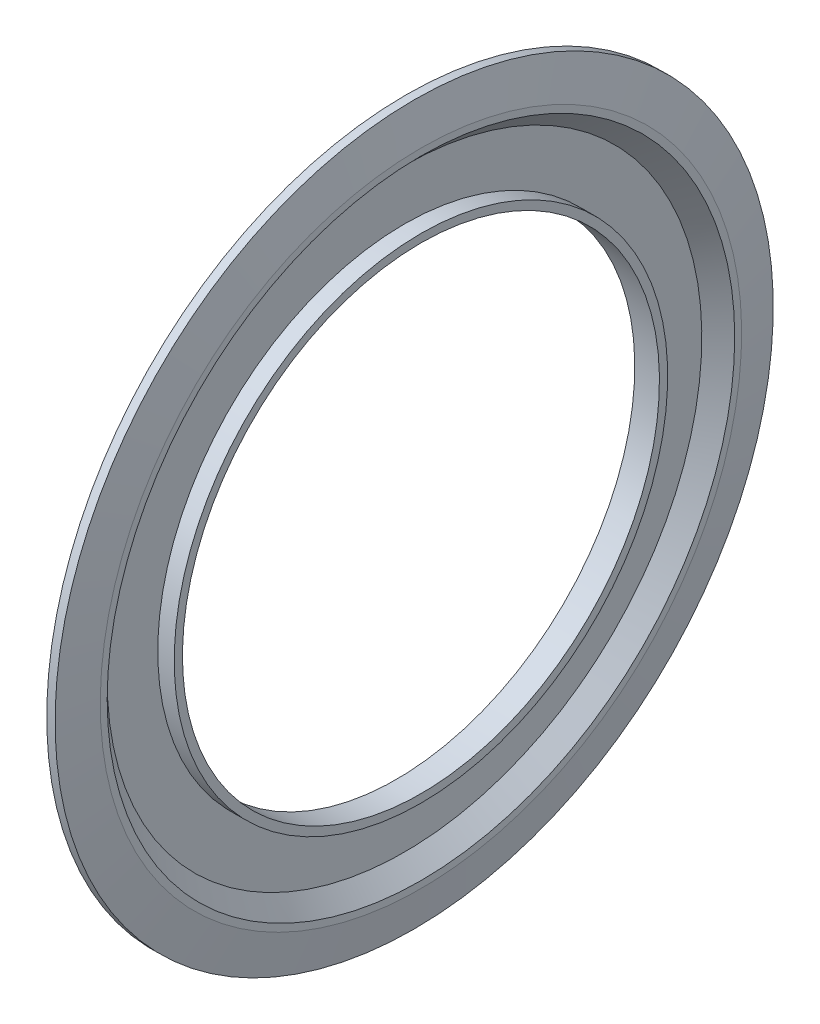
ISO-10303-21;
HEADER;
FILE_DESCRIPTION(('STEP AP214'),'2;1');
FILE_NAME('part.step','',(''),(''),'','','');
FILE_SCHEMA(('AUTOMOTIVE_DESIGN { 1 0 10303 214 1 1 1 1 }'));
ENDSEC;
DATA;
#1=APPLICATION_CONTEXT('core data for automotive mechanical design processes');
#2=APPLICATION_PROTOCOL_DEFINITION('international standard','automotive_design',2000,#1);
#3=PRODUCT_CONTEXT('',#1,'mechanical');
#4=PRODUCT('Part','Part','',(#3));
#5=PRODUCT_RELATED_PRODUCT_CATEGORY('part','',(#4));
#6=PRODUCT_DEFINITION_FORMATION('','',#4);
#7=PRODUCT_DEFINITION_CONTEXT('part definition',#1,'design');
#8=PRODUCT_DEFINITION('design','',#6,#7);
#9=PRODUCT_DEFINITION_SHAPE('','',#8);
#10=(LENGTH_UNIT() NAMED_UNIT(*) SI_UNIT(.MILLI.,.METRE.));
#11=(NAMED_UNIT(*) PLANE_ANGLE_UNIT() SI_UNIT($,.RADIAN.));
#12=(NAMED_UNIT(*) SI_UNIT($,.STERADIAN.) SOLID_ANGLE_UNIT());
#13=UNCERTAINTY_MEASURE_WITH_UNIT(LENGTH_MEASURE(1.E-05),#10,'distance_accuracy_value','');
#14=(GEOMETRIC_REPRESENTATION_CONTEXT(3) GLOBAL_UNCERTAINTY_ASSIGNED_CONTEXT((#13)) GLOBAL_UNIT_ASSIGNED_CONTEXT((#10,
#11,#12)) REPRESENTATION_CONTEXT('',''));
#15=CARTESIAN_POINT('',(0.,0.,0.));
#16=DIRECTION('',(0.,0.,1.));
#17=DIRECTION('',(1.,0.,0.));
#18=AXIS2_PLACEMENT_3D('',#15,#16,#17);
#19=CARTESIAN_POINT('',(0.762871315483505,7.518,0.));
#20=DIRECTION('',(1.,0.,0.));
#21=DIRECTION('',(0.,-1.,0.));
#22=AXIS2_PLACEMENT_3D('',#19,#20,#21);
#23=PLANE('',#22);
#24=CARTESIAN_POINT('',(0.762871315483505,0.,0.));
#25=DIRECTION('',(-1.,0.,0.));
#26=DIRECTION('',(0.,1.,0.));
#27=AXIS2_PLACEMENT_3D('',#24,#25,#26);
#28=CIRCLE('',#27,7.436);
#29=CARTESIAN_POINT('',(0.762871315483505,7.436,0.));
#30=VERTEX_POINT('',#29);
#31=EDGE_CURVE('E11',#30,#30,#28,.T.);
#32=ORIENTED_EDGE('',*,*,#31,.T.);
#33=EDGE_LOOP('',(#32));
#34=FACE_BOUND('',#33,.T.);
#35=CARTESIAN_POINT('',(0.762871315483505,0.,0.));
#36=DIRECTION('',(-1.,0.,0.));
#37=DIRECTION('',(0.,1.,0.));
#38=AXIS2_PLACEMENT_3D('',#35,#36,#37);
#39=CIRCLE('',#38,7.6);
#40=CARTESIAN_POINT('',(0.762871315483505,7.6,0.));
#41=VERTEX_POINT('',#40);
#42=EDGE_CURVE('E69',#41,#41,#39,.T.);
#43=ORIENTED_EDGE('',*,*,#42,.F.);
#44=EDGE_LOOP('',(#43));
#45=FACE_BOUND('',#44,.T.);
#46=ADVANCED_FACE('F16',(#34,#45),#23,.T.);
#47=CARTESIAN_POINT('',(0.567871315483505,0.,0.));
#48=DIRECTION('',(1.,0.,0.));
#49=DIRECTION('',(0.,1.,0.));
#50=AXIS2_PLACEMENT_3D('',#47,#48,#49);
#51=CONICAL_SURFACE('',#50,7.241,0.785398163397447);
#52=CARTESIAN_POINT('',(0.372871315483505,0.,0.));
#53=DIRECTION('',(-1.,0.,0.));
#54=DIRECTION('',(0.,1.,0.));
#55=AXIS2_PLACEMENT_3D('',#52,#53,#54);
#56=CIRCLE('',#55,7.046);
#57=CARTESIAN_POINT('',(0.372871315483505,7.046,0.));
#58=VERTEX_POINT('',#57);
#59=EDGE_CURVE('E20',#58,#58,#56,.T.);
#60=ORIENTED_EDGE('',*,*,#59,.T.);
#61=EDGE_LOOP('',(#60));
#62=FACE_BOUND('',#61,.T.);
#63=ORIENTED_EDGE('',*,*,#31,.F.);
#64=EDGE_LOOP('',(#63));
#65=FACE_BOUND('',#64,.T.);
#66=ADVANCED_FACE('F18',(#62,#65),#51,.F.);
#67=CARTESIAN_POINT('',(0.372871315483504,6.44675,0.));
#68=DIRECTION('',(1.,0.,0.));
#69=DIRECTION('',(0.,-1.,0.));
#70=AXIS2_PLACEMENT_3D('',#67,#68,#69);
#71=PLANE('',#70);
#72=CARTESIAN_POINT('',(0.372871315483504,0.,0.));
#73=DIRECTION('',(-1.,0.,0.));
#74=DIRECTION('',(0.,1.,0.));
#75=AXIS2_PLACEMENT_3D('',#72,#73,#74);
#76=CIRCLE('',#75,5.8475);
#77=CARTESIAN_POINT('',(0.372871315483504,5.8475,0.));
#78=VERTEX_POINT('',#77);
#79=EDGE_CURVE('E82',#78,#78,#76,.T.);
#80=ORIENTED_EDGE('',*,*,#79,.T.);
#81=EDGE_LOOP('',(#80));
#82=FACE_BOUND('',#81,.T.);
#83=ORIENTED_EDGE('',*,*,#59,.F.);
#84=EDGE_LOOP('',(#83));
#85=FACE_BOUND('',#84,.T.);
#86=ADVANCED_FACE('F117',(#82,#85),#71,.T.);
#87=CARTESIAN_POINT('',(0.567871315483505,0.,0.));
#88=DIRECTION('',(1.,0.,0.));
#89=DIRECTION('',(0.,1.,0.));
#90=AXIS2_PLACEMENT_3D('',#87,#88,#89);
#91=CYLINDRICAL_SURFACE('',#90,5.8475);
#92=CARTESIAN_POINT('',(0.762871315483505,0.,0.));
#93=DIRECTION('',(-1.,0.,0.));
#94=DIRECTION('',(0.,1.,0.));
#95=AXIS2_PLACEMENT_3D('',#92,#93,#94);
#96=CIRCLE('',#95,5.8475);
#97=CARTESIAN_POINT('',(0.762871315483505,5.8475,0.));
#98=VERTEX_POINT('',#97);
#99=EDGE_CURVE('E80',#98,#98,#96,.T.);
#100=ORIENTED_EDGE('',*,*,#99,.T.);
#101=EDGE_LOOP('',(#100));
#102=FACE_BOUND('',#101,.T.);
#103=ORIENTED_EDGE('',*,*,#79,.F.);
#104=EDGE_LOOP('',(#103));
#105=FACE_BOUND('',#104,.T.);
#106=ADVANCED_FACE('F128',(#102,#105),#91,.T.);
#107=CARTESIAN_POINT('',(0.762871315483505,5.75,0.));
#108=DIRECTION('',(1.,0.,0.));
#109=DIRECTION('',(0.,-1.,0.));
#110=AXIS2_PLACEMENT_3D('',#107,#108,#109);
#111=PLANE('',#110);
#112=CARTESIAN_POINT('',(0.762871315483505,0.,0.));
#113=DIRECTION('',(-1.,0.,0.));
#114=DIRECTION('',(0.,1.,0.));
#115=AXIS2_PLACEMENT_3D('',#112,#113,#114);
#116=CIRCLE('',#115,5.6525);
#117=CARTESIAN_POINT('',(0.762871315483505,5.6525,0.));
#118=VERTEX_POINT('',#117);
#119=EDGE_CURVE('E79',#118,#118,#116,.T.);
#120=ORIENTED_EDGE('',*,*,#119,.T.);
#121=EDGE_LOOP('',(#120));
#122=FACE_BOUND('',#121,.T.);
#123=ORIENTED_EDGE('',*,*,#99,.F.);
#124=EDGE_LOOP('',(#123));
#125=FACE_BOUND('',#124,.T.);
#126=ADVANCED_FACE('F126',(#122,#125),#111,.T.);
#127=CARTESIAN_POINT('',(0.470371315483504,0.,0.));
#128=DIRECTION('',(1.,0.,0.));
#129=DIRECTION('',(0.,1.,0.));
#130=AXIS2_PLACEMENT_3D('',#127,#128,#129);
#131=CYLINDRICAL_SURFACE('',#130,5.6525);
#132=CARTESIAN_POINT('',(0.177871315483505,0.,0.));
#133=DIRECTION('',(-1.,0.,0.));
#134=DIRECTION('',(0.,1.,0.));
#135=AXIS2_PLACEMENT_3D('',#132,#133,#134);
#136=CIRCLE('',#135,5.6525);
#137=CARTESIAN_POINT('',(0.177871315483505,5.6525,0.));
#138=VERTEX_POINT('',#137);
#139=EDGE_CURVE('E81',#138,#138,#136,.T.);
#140=ORIENTED_EDGE('',*,*,#139,.T.);
#141=EDGE_LOOP('',(#140));
#142=FACE_BOUND('',#141,.T.);
#143=ORIENTED_EDGE('',*,*,#119,.F.);
#144=EDGE_LOOP('',(#143));
#145=FACE_BOUND('',#144,.T.);
#146=ADVANCED_FACE('F109',(#142,#145),#131,.F.);
#147=CARTESIAN_POINT('',(0.177871315483505,6.38963582233138,0.));
#148=DIRECTION('',(-1.,0.,0.));
#149=DIRECTION('',(0.,1.,0.));
#150=AXIS2_PLACEMENT_3D('',#147,#148,#149);
#151=PLANE('',#150);
#152=CARTESIAN_POINT('',(0.177871315483505,0.,0.));
#153=DIRECTION('',(-1.,0.,0.));
#154=DIRECTION('',(0.,1.,0.));
#155=AXIS2_PLACEMENT_3D('',#152,#153,#154);
#156=CIRCLE('',#155,7.12677164466275);
#157=CARTESIAN_POINT('',(0.177871315483505,7.12677164466275,0.));
#158=VERTEX_POINT('',#157);
#159=EDGE_CURVE('E78',#158,#158,#156,.T.);
#160=ORIENTED_EDGE('',*,*,#159,.T.);
#161=EDGE_LOOP('',(#160));
#162=FACE_BOUND('',#161,.T.);
#163=ORIENTED_EDGE('',*,*,#139,.F.);
#164=EDGE_LOOP('',(#163));
#165=FACE_BOUND('',#164,.T.);
#166=ADVANCED_FACE('F94',(#162,#165),#151,.T.);
#167=CARTESIAN_POINT('',(0.372871315483505,0.,0.));
#168=DIRECTION('',(1.,0.,0.));
#169=DIRECTION('',(0.,1.,0.));
#170=AXIS2_PLACEMENT_3D('',#167,#168,#169);
#171=CONICAL_SURFACE('',#170,7.32177164466275,0.785398163397447);
#172=CARTESIAN_POINT('',(0.567871315483505,0.,0.));
#173=DIRECTION('',(-1.,0.,0.));
#174=DIRECTION('',(0.,1.,0.));
#175=AXIS2_PLACEMENT_3D('',#172,#173,#174);
#176=CIRCLE('',#175,7.51677164466275);
#177=CARTESIAN_POINT('',(0.567871315483505,7.51677164466275,0.));
#178=VERTEX_POINT('',#177);
#179=EDGE_CURVE('E71',#178,#178,#176,.T.);
#180=ORIENTED_EDGE('',*,*,#179,.T.);
#181=EDGE_LOOP('',(#180));
#182=FACE_BOUND('',#181,.T.);
#183=ORIENTED_EDGE('',*,*,#159,.F.);
#184=EDGE_LOOP('',(#183));
#185=FACE_BOUND('',#184,.T.);
#186=ADVANCED_FACE('F97',(#182,#185),#171,.T.);
#187=CARTESIAN_POINT('',(0.567871315483505,7.5498556776376,0.));
#188=DIRECTION('',(-1.,0.,0.));
#189=DIRECTION('',(0.,1.,0.));
#190=AXIS2_PLACEMENT_3D('',#187,#188,#189);
#191=PLANE('',#190);
#192=CARTESIAN_POINT('',(0.567871315483505,0.,0.));
#193=DIRECTION('',(-1.,0.,0.));
#194=DIRECTION('',(0.,1.,0.));
#195=AXIS2_PLACEMENT_3D('',#192,#193,#194);
#196=CIRCLE('',#195,7.58293971061244);
#197=CARTESIAN_POINT('',(0.567871315483505,7.58293971061244,0.));
#198=VERTEX_POINT('',#197);
#199=EDGE_CURVE('E68',#198,#198,#196,.T.);
#200=ORIENTED_EDGE('',*,*,#199,.T.);
#201=EDGE_LOOP('',(#200));
#202=FACE_BOUND('',#201,.T.);
#203=ORIENTED_EDGE('',*,*,#179,.F.);
#204=EDGE_LOOP('',(#203));
#205=FACE_BOUND('',#204,.T.);
#206=ADVANCED_FACE('F99',(#202,#205),#191,.T.);
#207=CARTESIAN_POINT('',(0.486138444602293,0.,0.));
#208=DIRECTION('',(-1.,0.,0.));
#209=DIRECTION('',(0.,1.,0.));
#210=AXIS2_PLACEMENT_3D('',#207,#208,#209);
#211=CONICAL_SURFACE('',#210,8.04646985530622,1.39626340159546);
#212=CARTESIAN_POINT('',(0.404405573721081,0.,0.));
#213=DIRECTION('',(-1.,0.,0.));
#214=DIRECTION('',(0.,1.,0.));
#215=AXIS2_PLACEMENT_3D('',#212,#213,#214);
#216=CIRCLE('',#215,8.51);
#217=CARTESIAN_POINT('',(0.404405573721081,8.51,0.));
#218=VERTEX_POINT('',#217);
#219=EDGE_CURVE('E64',#218,#218,#216,.T.);
#220=ORIENTED_EDGE('',*,*,#219,.T.);
#221=EDGE_LOOP('',(#220));
#222=FACE_BOUND('',#221,.T.);
#223=ORIENTED_EDGE('',*,*,#199,.F.);
#224=EDGE_LOOP('',(#223));
#225=FACE_BOUND('',#224,.T.);
#226=ADVANCED_FACE('F65',(#222,#225),#211,.F.);
#227=CARTESIAN_POINT('',(0.503409668379941,0.,0.));
#228=DIRECTION('',(1.,0.,0.));
#229=DIRECTION('',(0.,1.,0.));
#230=AXIS2_PLACEMENT_3D('',#227,#228,#229);
#231=CYLINDRICAL_SURFACE('',#230,8.51);
#232=CARTESIAN_POINT('',(0.602413763038801,0.,0.));
#233=DIRECTION('',(-1.,0.,0.));
#234=DIRECTION('',(0.,1.,0.));
#235=AXIS2_PLACEMENT_3D('',#232,#233,#234);
#236=CIRCLE('',#235,8.51);
#237=CARTESIAN_POINT('',(0.602413763038801,8.51,0.));
#238=VERTEX_POINT('',#237);
#239=EDGE_CURVE('E73',#238,#238,#236,.T.);
#240=ORIENTED_EDGE('',*,*,#239,.T.);
#241=EDGE_LOOP('',(#240));
#242=FACE_BOUND('',#241,.T.);
#243=ORIENTED_EDGE('',*,*,#219,.F.);
#244=EDGE_LOOP('',(#243));
#245=FACE_BOUND('',#244,.T.);
#246=ADVANCED_FACE('F120',(#242,#245),#231,.T.);
#247=CARTESIAN_POINT('',(0.682642539261154,0.,0.));
#248=DIRECTION('',(-1.,0.,0.));
#249=DIRECTION('',(0.,1.,0.));
#250=AXIS2_PLACEMENT_3D('',#247,#248,#249);
#251=CONICAL_SURFACE('',#250,8.055,1.39626340159546);
#252=ORIENTED_EDGE('',*,*,#42,.T.);
#253=EDGE_LOOP('',(#252));
#254=FACE_BOUND('',#253,.T.);
#255=ORIENTED_EDGE('',*,*,#239,.F.);
#256=EDGE_LOOP('',(#255));
#257=FACE_BOUND('',#256,.T.);
#258=ADVANCED_FACE('F123',(#254,#257),#251,.T.);
#259=CLOSED_SHELL('',(#46,#66,#86,#106,#126,#146,#166,#186,#206,#226,#246,#258));
#260=MANIFOLD_SOLID_BREP('B1',#259);
#261=ADVANCED_BREP_SHAPE_REPRESENTATION('',(#18,#260),#14);
#262=SHAPE_DEFINITION_REPRESENTATION(#9,#261);
ENDSEC;
END-ISO-10303-21;
